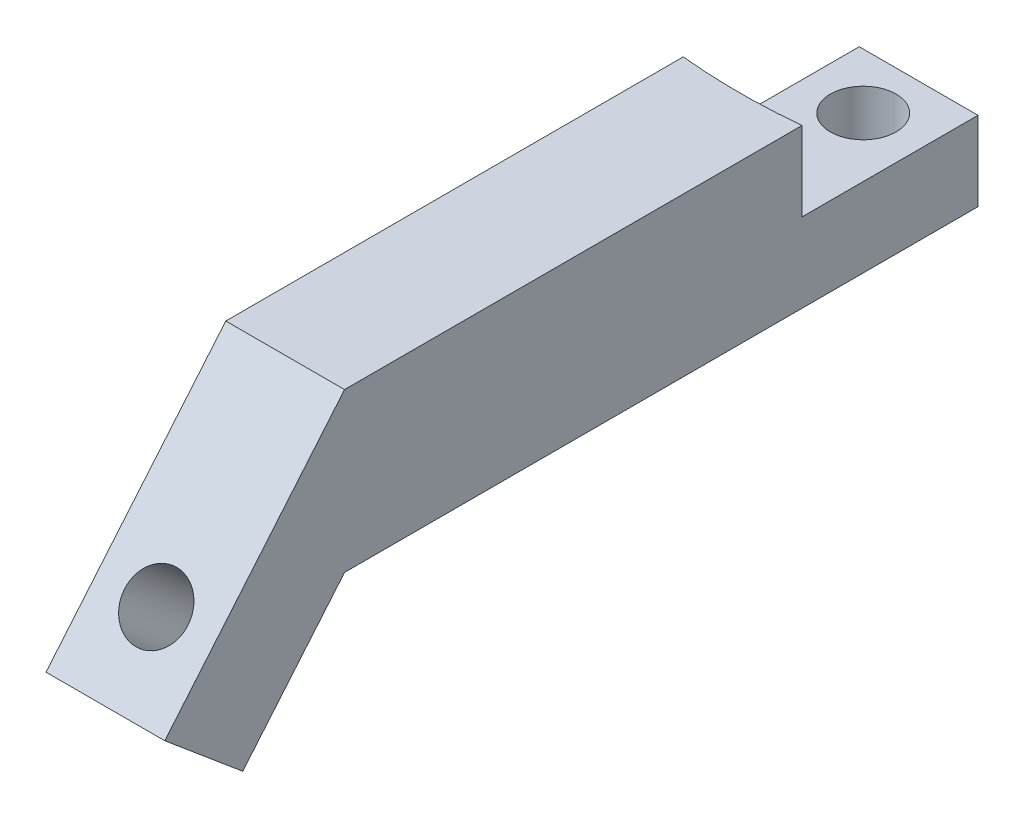
ISO-10303-21;
HEADER;
FILE_DESCRIPTION(('STEP AP214'),'2;1');
FILE_NAME('part.step','',(''),(''),'','','');
FILE_SCHEMA(('AUTOMOTIVE_DESIGN { 1 0 10303 214 1 1 1 1 }'));
ENDSEC;
DATA;
#1=APPLICATION_CONTEXT('core data for automotive mechanical design processes');
#2=APPLICATION_PROTOCOL_DEFINITION('international standard','automotive_design',2000,#1);
#3=PRODUCT_CONTEXT('',#1,'mechanical');
#4=PRODUCT('Part','Part','',(#3));
#5=PRODUCT_RELATED_PRODUCT_CATEGORY('part','',(#4));
#6=PRODUCT_DEFINITION_FORMATION('','',#4);
#7=PRODUCT_DEFINITION_CONTEXT('part definition',#1,'design');
#8=PRODUCT_DEFINITION('design','',#6,#7);
#9=PRODUCT_DEFINITION_SHAPE('','',#8);
#10=(LENGTH_UNIT() NAMED_UNIT(*) SI_UNIT(.MILLI.,.METRE.));
#11=(NAMED_UNIT(*) PLANE_ANGLE_UNIT() SI_UNIT($,.RADIAN.));
#12=(NAMED_UNIT(*) SI_UNIT($,.STERADIAN.) SOLID_ANGLE_UNIT());
#13=UNCERTAINTY_MEASURE_WITH_UNIT(LENGTH_MEASURE(1.E-05),#10,'distance_accuracy_value','');
#14=(GEOMETRIC_REPRESENTATION_CONTEXT(3) GLOBAL_UNCERTAINTY_ASSIGNED_CONTEXT((#13)) GLOBAL_UNIT_ASSIGNED_CONTEXT((#10,
#11,#12)) REPRESENTATION_CONTEXT('',''));
#15=CARTESIAN_POINT('',(0.,0.,0.));
#16=DIRECTION('',(0.,0.,1.));
#17=DIRECTION('',(1.,0.,0.));
#18=AXIS2_PLACEMENT_3D('',#15,#16,#17);
#19=CARTESIAN_POINT('',(0.,10.,0.));
#20=DIRECTION('',(0.,1.,0.));
#21=DIRECTION('',(0.,0.,1.));
#22=AXIS2_PLACEMENT_3D('',#19,#20,#21);
#23=PLANE('',#22);
#24=CARTESIAN_POINT('',(0.,10.,-33.));
#25=DIRECTION('',(0.,1.,0.));
#26=DIRECTION('',(0.,0.,1.));
#27=AXIS2_PLACEMENT_3D('',#24,#25,#26);
#28=CIRCLE('',#27,4.15);
#29=CARTESIAN_POINT('',(0.,10.,-28.85));
#30=VERTEX_POINT('',#29);
#31=EDGE_CURVE('E95',#30,#30,#28,.T.);
#32=ORIENTED_EDGE('',*,*,#31,.F.);
#33=EDGE_LOOP('',(#32));
#34=FACE_BOUND('',#33,.T.);
#35=CARTESIAN_POINT('',(0.,10.,-92.4));
#36=DIRECTION('',(0.,-1.,0.));
#37=DIRECTION('',(0.,0.,-1.));
#38=AXIS2_PLACEMENT_3D('',#35,#36,#37);
#39=CIRCLE('',#38,75.);
#40=CARTESIAN_POINT('',(7.5,10.,-17.7759422170035));
#41=VERTEX_POINT('',#40);
#42=CARTESIAN_POINT('',(-7.5,10.,-17.7759422170035));
#43=VERTEX_POINT('',#42);
#44=EDGE_CURVE('E51',#41,#43,#39,.T.);
#45=ORIENTED_EDGE('',*,*,#44,.F.);
#46=DIRECTION('',(0.,0.,-1.));
#47=VECTOR('',#46,1.);
#48=CARTESIAN_POINT('',(7.50000000000001,10.,40.));
#49=LINE('',#48,#47);
#50=CARTESIAN_POINT('',(7.5,10.,-40.));
#51=VERTEX_POINT('',#50);
#52=EDGE_CURVE('E160',#41,#51,#49,.T.);
#53=ORIENTED_EDGE('',*,*,#52,.T.);
#54=DIRECTION('',(-1.,0.,0.));
#55=VECTOR('',#54,1.);
#56=CARTESIAN_POINT('',(7.5,10.,-40.));
#57=LINE('',#56,#55);
#58=CARTESIAN_POINT('',(-7.5,10.,-40.));
#59=VERTEX_POINT('',#58);
#60=EDGE_CURVE('E57',#51,#59,#57,.T.);
#61=ORIENTED_EDGE('',*,*,#60,.T.);
#62=DIRECTION('',(0.,0.,1.));
#63=VECTOR('',#62,1.);
#64=CARTESIAN_POINT('',(-7.49999999999999,10.,40.));
#65=LINE('',#64,#63);
#66=EDGE_CURVE('E79',#59,#43,#65,.T.);
#67=ORIENTED_EDGE('',*,*,#66,.T.);
#68=EDGE_LOOP('',(#45,#53,#61,#67));
#69=FACE_BOUND('',#68,.T.);
#70=ADVANCED_FACE('F35',(#34,#69),#23,.T.);
#71=CARTESIAN_POINT('',(0.,0.,0.));
#72=DIRECTION('',(0.,1.,0.));
#73=DIRECTION('',(0.,0.,1.));
#74=AXIS2_PLACEMENT_3D('',#71,#72,#73);
#75=PLANE('',#74);
#76=DIRECTION('',(0.,0.,1.));
#77=VECTOR('',#76,1.);
#78=CARTESIAN_POINT('',(-7.49999999999999,0.,40.));
#79=LINE('',#78,#77);
#80=CARTESIAN_POINT('',(-7.5,0.,-40.));
#81=VERTEX_POINT('',#80);
#82=CARTESIAN_POINT('',(-7.49999999999999,0.,40.));
#83=VERTEX_POINT('',#82);
#84=EDGE_CURVE('E86',#81,#83,#79,.T.);
#85=ORIENTED_EDGE('',*,*,#84,.F.);
#86=DIRECTION('',(-1.,0.,0.));
#87=VECTOR('',#86,1.);
#88=CARTESIAN_POINT('',(7.5,0.,-40.));
#89=LINE('',#88,#87);
#90=CARTESIAN_POINT('',(7.5,0.,-40.));
#91=VERTEX_POINT('',#90);
#92=EDGE_CURVE('E72',#91,#81,#89,.T.);
#93=ORIENTED_EDGE('',*,*,#92,.F.);
#94=DIRECTION('',(0.,0.,-1.));
#95=VECTOR('',#94,1.);
#96=CARTESIAN_POINT('',(7.50000000000001,0.,40.));
#97=LINE('',#96,#95);
#98=CARTESIAN_POINT('',(7.50000000000001,0.,40.));
#99=VERTEX_POINT('',#98);
#100=EDGE_CURVE('E80',#99,#91,#97,.T.);
#101=ORIENTED_EDGE('',*,*,#100,.F.);
#102=DIRECTION('',(1.,0.,0.));
#103=VECTOR('',#102,1.);
#104=CARTESIAN_POINT('',(7.50000000000001,0.,40.));
#105=LINE('',#104,#103);
#106=EDGE_CURVE('E93',#83,#99,#105,.T.);
#107=ORIENTED_EDGE('',*,*,#106,.F.);
#108=EDGE_LOOP('',(#85,#93,#101,#107));
#109=FACE_BOUND('',#108,.T.);
#110=CARTESIAN_POINT('',(0.,0.,-33.));
#111=DIRECTION('',(0.,1.,0.));
#112=DIRECTION('',(0.,0.,1.));
#113=AXIS2_PLACEMENT_3D('',#110,#111,#112);
#114=CIRCLE('',#113,4.15);
#115=CARTESIAN_POINT('',(0.,0.,-28.85));
#116=VERTEX_POINT('',#115);
#117=EDGE_CURVE('E99',#116,#116,#114,.T.);
#118=ORIENTED_EDGE('',*,*,#117,.T.);
#119=EDGE_LOOP('',(#118));
#120=FACE_BOUND('',#119,.T.);
#121=ADVANCED_FACE('F90',(#109,#120),#75,.F.);
#122=CARTESIAN_POINT('',(-7.49999999999999,10.,40.));
#123=DIRECTION('',(1.,0.,0.));
#124=DIRECTION('',(0.,0.,-1.));
#125=AXIS2_PLACEMENT_3D('',#122,#123,#124);
#126=PLANE('',#125);
#127=ORIENTED_EDGE('',*,*,#84,.T.);
#128=DIRECTION('',(0.,-0.766044443118975,0.642787609686543));
#129=VECTOR('',#128,1.);
#130=CARTESIAN_POINT('',(-7.49999999999999,0.,40.));
#131=LINE('',#130,#129);
#132=CARTESIAN_POINT('',(-7.49999999999999,-15.3208888623795,52.8557521937309));
#133=VERTEX_POINT('',#132);
#134=EDGE_CURVE('E114',#83,#133,#131,.T.);
#135=ORIENTED_EDGE('',*,*,#134,.T.);
#136=DIRECTION('',(0.,0.642787609686543,0.766044443118975));
#137=VECTOR('',#136,1.);
#138=CARTESIAN_POINT('',(-7.49999999999999,-15.3208888623795,52.8557521937309));
#139=LINE('',#138,#137);
#140=CARTESIAN_POINT('',(-7.49999999999999,-7.05737063904871,62.703829723853));
#141=VERTEX_POINT('',#140);
#142=EDGE_CURVE('E123',#133,#141,#139,.T.);
#143=ORIENTED_EDGE('',*,*,#142,.T.);
#144=DIRECTION('',(0.,0.766044443118975,-0.642787609686543));
#145=VECTOR('',#144,1.);
#146=CARTESIAN_POINT('',(-7.49999999999999,-7.05737063904871,62.703829723853));
#147=LINE('',#146,#145);
#148=CARTESIAN_POINT('',(-7.49999999999999,20.,40.));
#149=VERTEX_POINT('',#148);
#150=EDGE_CURVE('E122',#141,#149,#147,.T.);
#151=ORIENTED_EDGE('',*,*,#150,.T.);
#152=DIRECTION('',(0.,0.,1.));
#153=VECTOR('',#152,1.);
#154=CARTESIAN_POINT('',(-7.49999999999999,20.,40.));
#155=LINE('',#154,#153);
#156=CARTESIAN_POINT('',(-7.5,20.,-17.7759422170035));
#157=VERTEX_POINT('',#156);
#158=EDGE_CURVE('E143',#157,#149,#155,.T.);
#159=ORIENTED_EDGE('',*,*,#158,.F.);
#160=DIRECTION('',(0.,-1.,0.));
#161=VECTOR('',#160,1.);
#162=CARTESIAN_POINT('',(-7.5,20.,-17.7759422170035));
#163=LINE('',#162,#161);
#164=EDGE_CURVE('E156',#157,#43,#163,.T.);
#165=ORIENTED_EDGE('',*,*,#164,.T.);
#166=ORIENTED_EDGE('',*,*,#66,.F.);
#167=DIRECTION('',(0.,-1.,0.));
#168=VECTOR('',#167,1.);
#169=CARTESIAN_POINT('',(-7.5,10.,-40.));
#170=LINE('',#169,#168);
#171=EDGE_CURVE('E44',#59,#81,#170,.T.);
#172=ORIENTED_EDGE('',*,*,#171,.T.);
#173=EDGE_LOOP('',(#127,#135,#143,#151,#159,#165,#166,#172));
#174=FACE_BOUND('',#173,.T.);
#175=ADVANCED_FACE('F37',(#174),#126,.F.);
#176=CARTESIAN_POINT('',(7.50000000000001,10.,40.));
#177=DIRECTION('',(-1.,0.,0.));
#178=DIRECTION('',(0.,0.,1.));
#179=AXIS2_PLACEMENT_3D('',#176,#177,#178);
#180=PLANE('',#179);
#181=ORIENTED_EDGE('',*,*,#100,.T.);
#182=DIRECTION('',(0.,-1.,0.));
#183=VECTOR('',#182,1.);
#184=CARTESIAN_POINT('',(7.5,10.,-40.));
#185=LINE('',#184,#183);
#186=EDGE_CURVE('E11',#51,#91,#185,.T.);
#187=ORIENTED_EDGE('',*,*,#186,.F.);
#188=ORIENTED_EDGE('',*,*,#52,.F.);
#189=DIRECTION('',(0.,-1.,0.));
#190=VECTOR('',#189,1.);
#191=CARTESIAN_POINT('',(7.50000000000001,20.,-17.7759422170035));
#192=LINE('',#191,#190);
#193=CARTESIAN_POINT('',(7.50000000000001,20.,-17.7759422170035));
#194=VERTEX_POINT('',#193);
#195=EDGE_CURVE('E152',#194,#41,#192,.T.);
#196=ORIENTED_EDGE('',*,*,#195,.F.);
#197=DIRECTION('',(0.,0.,-1.));
#198=VECTOR('',#197,1.);
#199=CARTESIAN_POINT('',(7.50000000000001,20.,-17.7759422170035));
#200=LINE('',#199,#198);
#201=CARTESIAN_POINT('',(7.50000000000001,20.,40.));
#202=VERTEX_POINT('',#201);
#203=EDGE_CURVE('E149',#202,#194,#200,.T.);
#204=ORIENTED_EDGE('',*,*,#203,.F.);
#205=DIRECTION('',(0.,-0.766044443118975,0.642787609686543));
#206=VECTOR('',#205,1.);
#207=CARTESIAN_POINT('',(7.50000000000002,-7.05737063904871,62.703829723853));
#208=LINE('',#207,#206);
#209=CARTESIAN_POINT('',(7.50000000000002,-7.05737063904871,62.703829723853));
#210=VERTEX_POINT('',#209);
#211=EDGE_CURVE('E130',#202,#210,#208,.T.);
#212=ORIENTED_EDGE('',*,*,#211,.T.);
#213=DIRECTION('',(0.,-0.642787609686543,-0.766044443118975));
#214=VECTOR('',#213,1.);
#215=CARTESIAN_POINT('',(7.50000000000001,-15.3208888623795,52.8557521937309));
#216=LINE('',#215,#214);
#217=CARTESIAN_POINT('',(7.50000000000001,-15.3208888623795,52.8557521937309));
#218=VERTEX_POINT('',#217);
#219=EDGE_CURVE('E133',#210,#218,#216,.T.);
#220=ORIENTED_EDGE('',*,*,#219,.T.);
#221=DIRECTION('',(0.,0.766044443118975,-0.642787609686543));
#222=VECTOR('',#221,1.);
#223=CARTESIAN_POINT('',(7.50000000000001,0.,40.));
#224=LINE('',#223,#222);
#225=EDGE_CURVE('E109',#218,#99,#224,.T.);
#226=ORIENTED_EDGE('',*,*,#225,.T.);
#227=EDGE_LOOP('',(#181,#187,#188,#196,#204,#212,#220,#226));
#228=FACE_BOUND('',#227,.T.);
#229=ADVANCED_FACE('F106',(#228),#180,.F.);
#230=CARTESIAN_POINT('',(7.5,10.,-40.));
#231=DIRECTION('',(0.,0.,1.));
#232=DIRECTION('',(1.,0.,0.));
#233=AXIS2_PLACEMENT_3D('',#230,#231,#232);
#234=PLANE('',#233);
#235=ORIENTED_EDGE('',*,*,#92,.T.);
#236=ORIENTED_EDGE('',*,*,#171,.F.);
#237=ORIENTED_EDGE('',*,*,#60,.F.);
#238=ORIENTED_EDGE('',*,*,#186,.T.);
#239=EDGE_LOOP('',(#235,#236,#237,#238));
#240=FACE_BOUND('',#239,.T.);
#241=ADVANCED_FACE('F74',(#240),#234,.F.);
#242=CARTESIAN_POINT('',(0.,10.,-33.));
#243=DIRECTION('',(0.,-1.,0.));
#244=DIRECTION('',(0.,0.,-1.));
#245=AXIS2_PLACEMENT_3D('',#242,#243,#244);
#246=CYLINDRICAL_SURFACE('',#245,4.15);
#247=ORIENTED_EDGE('',*,*,#31,.T.);
#248=EDGE_LOOP('',(#247));
#249=FACE_BOUND('',#248,.T.);
#250=ORIENTED_EDGE('',*,*,#117,.F.);
#251=EDGE_LOOP('',(#250));
#252=FACE_BOUND('',#251,.T.);
#253=ADVANCED_FACE('F212',(#249,#252),#246,.F.);
#254=CARTESIAN_POINT('',(0.,20.,-92.4));
#255=DIRECTION('',(0.,-1.,0.));
#256=DIRECTION('',(0.,0.,-1.));
#257=AXIS2_PLACEMENT_3D('',#254,#255,#256);
#258=CYLINDRICAL_SURFACE('',#257,75.);
#259=ORIENTED_EDGE('',*,*,#44,.T.);
#260=ORIENTED_EDGE('',*,*,#164,.F.);
#261=CARTESIAN_POINT('',(0.,20.,-92.4));
#262=DIRECTION('',(0.,-1.,0.));
#263=DIRECTION('',(0.,0.,-1.));
#264=AXIS2_PLACEMENT_3D('',#261,#262,#263);
#265=CIRCLE('',#264,75.);
#266=EDGE_CURVE('E140',#194,#157,#265,.T.);
#267=ORIENTED_EDGE('',*,*,#266,.F.);
#268=ORIENTED_EDGE('',*,*,#195,.T.);
#269=EDGE_LOOP('',(#259,#260,#267,#268));
#270=FACE_BOUND('',#269,.T.);
#271=ADVANCED_FACE('F165',(#270),#258,.F.);
#272=CARTESIAN_POINT('',(0.,20.,-92.4));
#273=DIRECTION('',(0.,-1.,0.));
#274=DIRECTION('',(0.,0.,-1.));
#275=AXIS2_PLACEMENT_3D('',#272,#273,#274);
#276=PLANE('',#275);
#277=ORIENTED_EDGE('',*,*,#266,.T.);
#278=ORIENTED_EDGE('',*,*,#158,.T.);
#279=DIRECTION('',(1.,0.,0.));
#280=VECTOR('',#279,1.);
#281=CARTESIAN_POINT('',(7.50000000000001,20.,40.));
#282=LINE('',#281,#280);
#283=EDGE_CURVE('E146',#149,#202,#282,.T.);
#284=ORIENTED_EDGE('',*,*,#283,.T.);
#285=ORIENTED_EDGE('',*,*,#203,.T.);
#286=EDGE_LOOP('',(#277,#278,#284,#285));
#287=FACE_BOUND('',#286,.T.);
#288=ADVANCED_FACE('F172',(#287),#276,.F.);
#289=CARTESIAN_POINT('',(-49.488439768087,0.,40.));
#290=DIRECTION('',(0.,-0.642787609686543,-0.766044443118975));
#291=DIRECTION('',(0.,0.766044443118975,-0.642787609686543));
#292=AXIS2_PLACEMENT_3D('',#289,#290,#291);
#293=PLANE('',#292);
#294=CARTESIAN_POINT('',(0.,-7.66044443118975,46.4278760968655));
#295=DIRECTION('',(0.,-0.642787609686543,-0.766044443118975));
#296=DIRECTION('',(0.,0.766044443118975,-0.642787609686543));
#297=AXIS2_PLACEMENT_3D('',#294,#295,#296);
#298=CIRCLE('',#297,4.);
#299=CARTESIAN_POINT('',(0.,-4.59626665871385,43.8567256581193));
#300=VERTEX_POINT('',#299);
#301=EDGE_CURVE('E307',#300,#300,#298,.T.);
#302=ORIENTED_EDGE('',*,*,#301,.F.);
#303=EDGE_LOOP('',(#302));
#304=FACE_BOUND('',#303,.T.);
#305=ORIENTED_EDGE('',*,*,#134,.F.);
#306=ORIENTED_EDGE('',*,*,#106,.T.);
#307=ORIENTED_EDGE('',*,*,#225,.F.);
#308=DIRECTION('',(1.,0.,0.));
#309=VECTOR('',#308,1.);
#310=CARTESIAN_POINT('',(-49.488439768087,-15.3208888623795,52.8557521937309));
#311=LINE('',#310,#309);
#312=EDGE_CURVE('E117',#133,#218,#311,.T.);
#313=ORIENTED_EDGE('',*,*,#312,.F.);
#314=EDGE_LOOP('',(#305,#306,#307,#313));
#315=FACE_BOUND('',#314,.T.);
#316=ADVANCED_FACE('F111',(#304,#315),#293,.T.);
#317=CARTESIAN_POINT('',(-49.488439768087,-15.3208888623795,52.8557521937309));
#318=DIRECTION('',(0.,-0.766044443118975,0.642787609686543));
#319=DIRECTION('',(0.,-0.642787609686543,-0.766044443118975));
#320=AXIS2_PLACEMENT_3D('',#317,#318,#319);
#321=PLANE('',#320);
#322=ORIENTED_EDGE('',*,*,#142,.F.);
#323=ORIENTED_EDGE('',*,*,#312,.T.);
#324=ORIENTED_EDGE('',*,*,#219,.F.);
#325=DIRECTION('',(1.,0.,0.));
#326=VECTOR('',#325,1.);
#327=CARTESIAN_POINT('',(-49.488439768087,-7.05737063904871,62.703829723853));
#328=LINE('',#327,#326);
#329=EDGE_CURVE('E136',#141,#210,#328,.T.);
#330=ORIENTED_EDGE('',*,*,#329,.F.);
#331=EDGE_LOOP('',(#322,#323,#324,#330));
#332=FACE_BOUND('',#331,.T.);
#333=ADVANCED_FACE('F189',(#332),#321,.T.);
#334=CARTESIAN_POINT('',(-49.488439768087,-7.05737063904871,62.703829723853));
#335=DIRECTION('',(0.,0.642787609686543,0.766044443118975));
#336=DIRECTION('',(0.,-0.766044443118975,0.642787609686543));
#337=AXIS2_PLACEMENT_3D('',#334,#335,#336);
#338=PLANE('',#337);
#339=CARTESIAN_POINT('',(0.,0.603073792141036,56.2759536269875));
#340=DIRECTION('',(0.,0.642787609686543,0.766044443118975));
#341=DIRECTION('',(0.,-0.766044443118975,0.642787609686543));
#342=AXIS2_PLACEMENT_3D('',#339,#340,#341);
#343=CIRCLE('',#342,4.);
#344=CARTESIAN_POINT('',(0.,-2.46110398033487,58.8471040657337));
#345=VERTEX_POINT('',#344);
#346=EDGE_CURVE('E39',#345,#345,#343,.T.);
#347=ORIENTED_EDGE('',*,*,#346,.F.);
#348=EDGE_LOOP('',(#347));
#349=FACE_BOUND('',#348,.T.);
#350=ORIENTED_EDGE('',*,*,#150,.F.);
#351=ORIENTED_EDGE('',*,*,#329,.T.);
#352=ORIENTED_EDGE('',*,*,#211,.F.);
#353=ORIENTED_EDGE('',*,*,#283,.F.);
#354=EDGE_LOOP('',(#350,#351,#352,#353));
#355=FACE_BOUND('',#354,.T.);
#356=ADVANCED_FACE('F184',(#349,#355),#338,.T.);
#357=CARTESIAN_POINT('',(0.,11.7825275597008,69.5991078177176));
#358=DIRECTION('',(0.,-0.642787609686543,-0.766044443118975));
#359=DIRECTION('',(0.,0.766044443118975,-0.642787609686543));
#360=AXIS2_PLACEMENT_3D('',#357,#358,#359);
#361=CYLINDRICAL_SURFACE('',#360,4.);
#362=ORIENTED_EDGE('',*,*,#346,.T.);
#363=EDGE_LOOP('',(#362));
#364=FACE_BOUND('',#363,.T.);
#365=ORIENTED_EDGE('',*,*,#301,.T.);
#366=EDGE_LOOP('',(#365));
#367=FACE_BOUND('',#366,.T.);
#368=ADVANCED_FACE('F198',(#364,#367),#361,.F.);
#369=CLOSED_SHELL('',(#70,#121,#175,#229,#241,#253,#271,#288,#316,#333,#356,#368));
#370=MANIFOLD_SOLID_BREP('B2',#369);
#371=ADVANCED_BREP_SHAPE_REPRESENTATION('',(#18,#370),#14);
#372=SHAPE_DEFINITION_REPRESENTATION(#9,#371);
ENDSEC;
END-ISO-10303-21;
